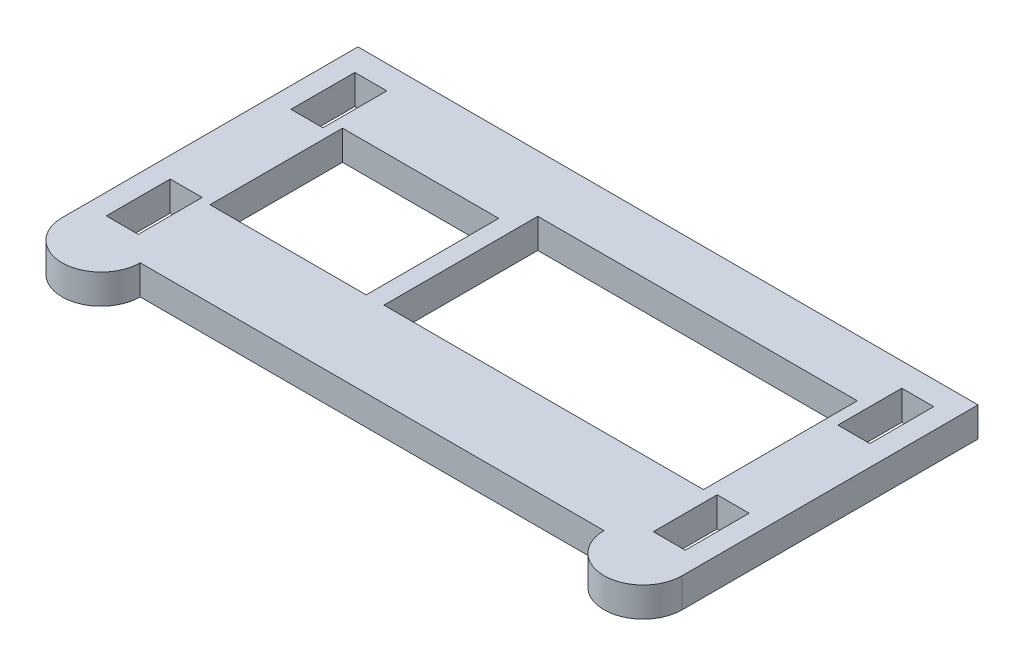
ISO-10303-21;
HEADER;
FILE_DESCRIPTION(('STEP AP214'),'2;1');
FILE_NAME('part.step','',(''),(''),'','','');
FILE_SCHEMA(('AUTOMOTIVE_DESIGN { 1 0 10303 214 1 1 1 1 }'));
ENDSEC;
DATA;
#1=APPLICATION_CONTEXT('core data for automotive mechanical design processes');
#2=APPLICATION_PROTOCOL_DEFINITION('international standard','automotive_design',2000,#1);
#3=PRODUCT_CONTEXT('',#1,'mechanical');
#4=PRODUCT('Part','Part','',(#3));
#5=PRODUCT_RELATED_PRODUCT_CATEGORY('part','',(#4));
#6=PRODUCT_DEFINITION_FORMATION('','',#4);
#7=PRODUCT_DEFINITION_CONTEXT('part definition',#1,'design');
#8=PRODUCT_DEFINITION('design','',#6,#7);
#9=PRODUCT_DEFINITION_SHAPE('','',#8);
#10=(LENGTH_UNIT() NAMED_UNIT(*) SI_UNIT(.MILLI.,.METRE.));
#11=(NAMED_UNIT(*) PLANE_ANGLE_UNIT() SI_UNIT($,.RADIAN.));
#12=(NAMED_UNIT(*) SI_UNIT($,.STERADIAN.) SOLID_ANGLE_UNIT());
#13=UNCERTAINTY_MEASURE_WITH_UNIT(LENGTH_MEASURE(1.E-05),#10,'distance_accuracy_value','');
#14=(GEOMETRIC_REPRESENTATION_CONTEXT(3) GLOBAL_UNCERTAINTY_ASSIGNED_CONTEXT((#13)) GLOBAL_UNIT_ASSIGNED_CONTEXT((#10,
#11,#12)) REPRESENTATION_CONTEXT('',''));
#15=CARTESIAN_POINT('',(0.,0.,0.));
#16=DIRECTION('',(0.,0.,1.));
#17=DIRECTION('',(1.,0.,0.));
#18=AXIS2_PLACEMENT_3D('',#15,#16,#17);
#19=CARTESIAN_POINT('',(-29.083,3.175,15.875));
#20=DIRECTION('',(0.,-1.,0.));
#21=DIRECTION('',(0.,0.,-1.));
#22=AXIS2_PLACEMENT_3D('',#19,#20,#21);
#23=PLANE('',#22);
#24=DIRECTION('',(0.,0.,1.));
#25=VECTOR('',#24,1.);
#26=CARTESIAN_POINT('',(-7.87399999999999,3.175,-9.77899999999999));
#27=LINE('',#26,#25);
#28=CARTESIAN_POINT('',(-7.87399999999999,3.175,-9.77899999999999));
#29=VERTEX_POINT('',#28);
#30=CARTESIAN_POINT('',(-7.87399999999999,3.175,6.73100000000001));
#31=VERTEX_POINT('',#30);
#32=EDGE_CURVE('E266',#29,#31,#27,.T.);
#33=ORIENTED_EDGE('',*,*,#32,.F.);
#34=DIRECTION('',(-1.,0.,0.));
#35=VECTOR('',#34,1.);
#36=CARTESIAN_POINT('',(-7.87399999999999,3.175,-9.77899999999999));
#37=LINE('',#36,#35);
#38=CARTESIAN_POINT('',(26.416,3.175,-9.77899999999999));
#39=VERTEX_POINT('',#38);
#40=EDGE_CURVE('E274',#39,#29,#37,.T.);
#41=ORIENTED_EDGE('',*,*,#40,.F.);
#42=DIRECTION('',(0.,0.,-1.));
#43=VECTOR('',#42,1.);
#44=CARTESIAN_POINT('',(26.416,3.175,-9.77899999999999));
#45=LINE('',#44,#43);
#46=CARTESIAN_POINT('',(26.416,3.175,6.73100000000001));
#47=VERTEX_POINT('',#46);
#48=EDGE_CURVE('E271',#47,#39,#45,.T.);
#49=ORIENTED_EDGE('',*,*,#48,.F.);
#50=DIRECTION('',(1.,0.,0.));
#51=VECTOR('',#50,1.);
#52=CARTESIAN_POINT('',(-7.87399999999999,3.175,6.73100000000001));
#53=LINE('',#52,#51);
#54=EDGE_CURVE('E268',#31,#47,#53,.T.);
#55=ORIENTED_EDGE('',*,*,#54,.F.);
#56=EDGE_LOOP('',(#33,#41,#49,#55));
#57=FACE_BOUND('',#56,.T.);
#58=DIRECTION('',(-1.,0.,0.));
#59=VECTOR('',#58,1.);
#60=CARTESIAN_POINT('',(-31.0642,3.175,6.47700000000002));
#61=LINE('',#60,#59);
#62=CARTESIAN_POINT('',(-27.6352,3.175,6.47700000000002));
#63=VERTEX_POINT('',#62);
#64=CARTESIAN_POINT('',(-31.0642,3.175,6.47700000000002));
#65=VERTEX_POINT('',#64);
#66=EDGE_CURVE('E328',#63,#65,#61,.T.);
#67=ORIENTED_EDGE('',*,*,#66,.F.);
#68=DIRECTION('',(0.,0.,-1.));
#69=VECTOR('',#68,1.);
#70=CARTESIAN_POINT('',(-27.6352,3.175,6.47700000000002));
#71=LINE('',#70,#69);
#72=CARTESIAN_POINT('',(-27.6352,3.175,13.335));
#73=VERTEX_POINT('',#72);
#74=EDGE_CURVE('E336',#73,#63,#71,.T.);
#75=ORIENTED_EDGE('',*,*,#74,.F.);
#76=DIRECTION('',(1.,0.,0.));
#77=VECTOR('',#76,1.);
#78=CARTESIAN_POINT('',(-31.0642,3.175,13.335));
#79=LINE('',#78,#77);
#80=CARTESIAN_POINT('',(-31.0642,3.175,13.335));
#81=VERTEX_POINT('',#80);
#82=EDGE_CURVE('E333',#81,#73,#79,.T.);
#83=ORIENTED_EDGE('',*,*,#82,.F.);
#84=DIRECTION('',(0.,0.,1.));
#85=VECTOR('',#84,1.);
#86=CARTESIAN_POINT('',(-31.0642,3.175,6.47700000000002));
#87=LINE('',#86,#85);
#88=EDGE_CURVE('E330',#65,#81,#87,.T.);
#89=ORIENTED_EDGE('',*,*,#88,.F.);
#90=EDGE_LOOP('',(#67,#75,#83,#89));
#91=FACE_BOUND('',#90,.T.);
#92=DIRECTION('',(0.,0.,-1.));
#93=VECTOR('',#92,1.);
#94=CARTESIAN_POINT('',(31.0642,3.175,-13.335));
#95=LINE('',#94,#93);
#96=CARTESIAN_POINT('',(31.0642,3.175,-6.477));
#97=VERTEX_POINT('',#96);
#98=CARTESIAN_POINT('',(31.0642,3.175,-13.335));
#99=VERTEX_POINT('',#98);
#100=EDGE_CURVE('E390',#97,#99,#95,.T.);
#101=ORIENTED_EDGE('',*,*,#100,.F.);
#102=DIRECTION('',(1.,0.,0.));
#103=VECTOR('',#102,1.);
#104=CARTESIAN_POINT('',(31.0642,3.175,-6.477));
#105=LINE('',#104,#103);
#106=CARTESIAN_POINT('',(27.6352,3.175,-6.477));
#107=VERTEX_POINT('',#106);
#108=EDGE_CURVE('E398',#107,#97,#105,.T.);
#109=ORIENTED_EDGE('',*,*,#108,.F.);
#110=DIRECTION('',(0.,0.,1.));
#111=VECTOR('',#110,1.);
#112=CARTESIAN_POINT('',(27.6352,3.175,-13.335));
#113=LINE('',#112,#111);
#114=CARTESIAN_POINT('',(27.6352,3.175,-13.335));
#115=VERTEX_POINT('',#114);
#116=EDGE_CURVE('E395',#115,#107,#113,.T.);
#117=ORIENTED_EDGE('',*,*,#116,.F.);
#118=DIRECTION('',(-1.,0.,0.));
#119=VECTOR('',#118,1.);
#120=CARTESIAN_POINT('',(31.0642,3.175,-13.335));
#121=LINE('',#120,#119);
#122=EDGE_CURVE('E392',#99,#115,#121,.T.);
#123=ORIENTED_EDGE('',*,*,#122,.F.);
#124=EDGE_LOOP('',(#101,#109,#117,#123));
#125=FACE_BOUND('',#124,.T.);
#126=DIRECTION('',(0.,0.,-1.));
#127=VECTOR('',#126,1.);
#128=CARTESIAN_POINT('',(33.274,3.175,15.875));
#129=LINE('',#128,#127);
#130=CARTESIAN_POINT('',(33.274,3.175,15.875));
#131=VERTEX_POINT('',#130);
#132=CARTESIAN_POINT('',(33.274,3.175,-15.875));
#133=VERTEX_POINT('',#132);
#134=EDGE_CURVE('E421',#131,#133,#129,.T.);
#135=ORIENTED_EDGE('',*,*,#134,.T.);
#136=DIRECTION('',(-1.,0.,0.));
#137=VECTOR('',#136,1.);
#138=CARTESIAN_POINT('',(-33.274,3.175,-15.875));
#139=LINE('',#138,#137);
#140=CARTESIAN_POINT('',(-33.274,3.175,-15.875));
#141=VERTEX_POINT('',#140);
#142=EDGE_CURVE('E424',#133,#141,#139,.T.);
#143=ORIENTED_EDGE('',*,*,#142,.T.);
#144=DIRECTION('',(0.,0.,1.));
#145=VECTOR('',#144,1.);
#146=CARTESIAN_POINT('',(-33.274,3.175,15.875));
#147=LINE('',#146,#145);
#148=CARTESIAN_POINT('',(-33.274,3.175,15.875));
#149=VERTEX_POINT('',#148);
#150=EDGE_CURVE('E427',#141,#149,#147,.T.);
#151=ORIENTED_EDGE('',*,*,#150,.T.);
#152=CARTESIAN_POINT('',(-29.083,3.175,15.875));
#153=DIRECTION('',(0.,1.,0.));
#154=DIRECTION('',(0.,0.,-1.));
#155=AXIS2_PLACEMENT_3D('',#152,#153,#154);
#156=CIRCLE('',#155,4.191);
#157=CARTESIAN_POINT('',(-24.892,3.175,15.875));
#158=VERTEX_POINT('',#157);
#159=EDGE_CURVE('E429',#149,#158,#156,.T.);
#160=ORIENTED_EDGE('',*,*,#159,.T.);
#161=DIRECTION('',(1.,0.,0.));
#162=VECTOR('',#161,1.);
#163=CARTESIAN_POINT('',(-24.892,3.175,15.875));
#164=LINE('',#163,#162);
#165=CARTESIAN_POINT('',(24.892,3.175,15.875));
#166=VERTEX_POINT('',#165);
#167=EDGE_CURVE('E431',#158,#166,#164,.T.);
#168=ORIENTED_EDGE('',*,*,#167,.T.);
#169=CARTESIAN_POINT('',(29.083,3.175,15.875));
#170=DIRECTION('',(0.,1.,0.));
#171=DIRECTION('',(0.,0.,1.));
#172=AXIS2_PLACEMENT_3D('',#169,#170,#171);
#173=CIRCLE('',#172,4.19099999999999);
#174=EDGE_CURVE('E433',#166,#131,#173,.T.);
#175=ORIENTED_EDGE('',*,*,#174,.T.);
#176=EDGE_LOOP('',(#135,#143,#151,#160,#168,#175));
#177=FACE_BOUND('',#176,.T.);
#178=DIRECTION('',(0.,0.,-1.));
#179=VECTOR('',#178,1.);
#180=CARTESIAN_POINT('',(31.0642,3.175,6.477));
#181=LINE('',#180,#179);
#182=CARTESIAN_POINT('',(31.0642,3.175,13.335));
#183=VERTEX_POINT('',#182);
#184=CARTESIAN_POINT('',(31.0642,3.175,6.477));
#185=VERTEX_POINT('',#184);
#186=EDGE_CURVE('E359',#183,#185,#181,.T.);
#187=ORIENTED_EDGE('',*,*,#186,.F.);
#188=DIRECTION('',(1.,0.,0.));
#189=VECTOR('',#188,1.);
#190=CARTESIAN_POINT('',(31.0642,3.175,13.335));
#191=LINE('',#190,#189);
#192=CARTESIAN_POINT('',(27.6352,3.175,13.335));
#193=VERTEX_POINT('',#192);
#194=EDGE_CURVE('E367',#193,#183,#191,.T.);
#195=ORIENTED_EDGE('',*,*,#194,.F.);
#196=DIRECTION('',(0.,0.,1.));
#197=VECTOR('',#196,1.);
#198=CARTESIAN_POINT('',(27.6352,3.175,6.477));
#199=LINE('',#198,#197);
#200=CARTESIAN_POINT('',(27.6352,3.175,6.477));
#201=VERTEX_POINT('',#200);
#202=EDGE_CURVE('E364',#201,#193,#199,.T.);
#203=ORIENTED_EDGE('',*,*,#202,.F.);
#204=DIRECTION('',(-1.,0.,0.));
#205=VECTOR('',#204,1.);
#206=CARTESIAN_POINT('',(31.0642,3.175,6.477));
#207=LINE('',#206,#205);
#208=EDGE_CURVE('E361',#185,#201,#207,.T.);
#209=ORIENTED_EDGE('',*,*,#208,.F.);
#210=EDGE_LOOP('',(#187,#195,#203,#209));
#211=FACE_BOUND('',#210,.T.);
#212=DIRECTION('',(-1.,0.,0.));
#213=VECTOR('',#212,1.);
#214=CARTESIAN_POINT('',(-31.0642,3.175,-13.335));
#215=LINE('',#214,#213);
#216=CARTESIAN_POINT('',(-27.6352,3.175,-13.335));
#217=VERTEX_POINT('',#216);
#218=CARTESIAN_POINT('',(-31.0642,3.175,-13.335));
#219=VERTEX_POINT('',#218);
#220=EDGE_CURVE('E297',#217,#219,#215,.T.);
#221=ORIENTED_EDGE('',*,*,#220,.F.);
#222=DIRECTION('',(0.,0.,-1.));
#223=VECTOR('',#222,1.);
#224=CARTESIAN_POINT('',(-27.6352,3.175,-13.335));
#225=LINE('',#224,#223);
#226=CARTESIAN_POINT('',(-27.6352,3.175,-6.47699999999999));
#227=VERTEX_POINT('',#226);
#228=EDGE_CURVE('E305',#227,#217,#225,.T.);
#229=ORIENTED_EDGE('',*,*,#228,.F.);
#230=DIRECTION('',(1.,0.,0.));
#231=VECTOR('',#230,1.);
#232=CARTESIAN_POINT('',(-31.0642,3.175,-6.47699999999998));
#233=LINE('',#232,#231);
#234=CARTESIAN_POINT('',(-31.0642,3.175,-6.47699999999998));
#235=VERTEX_POINT('',#234);
#236=EDGE_CURVE('E302',#235,#227,#233,.T.);
#237=ORIENTED_EDGE('',*,*,#236,.F.);
#238=DIRECTION('',(0.,0.,1.));
#239=VECTOR('',#238,1.);
#240=CARTESIAN_POINT('',(-31.0642,3.175,-13.335));
#241=LINE('',#240,#239);
#242=EDGE_CURVE('E299',#219,#235,#241,.T.);
#243=ORIENTED_EDGE('',*,*,#242,.F.);
#244=EDGE_LOOP('',(#221,#229,#237,#243));
#245=FACE_BOUND('',#244,.T.);
#246=DIRECTION('',(0.,0.,1.));
#247=VECTOR('',#246,1.);
#248=CARTESIAN_POINT('',(-26.543,3.175,-7.49299999999999));
#249=LINE('',#248,#247);
#250=CARTESIAN_POINT('',(-26.543,3.175,-7.49299999999999));
#251=VERTEX_POINT('',#250);
#252=CARTESIAN_POINT('',(-26.543,3.175,6.73100000000001));
#253=VERTEX_POINT('',#252);
#254=EDGE_CURVE('E230',#251,#253,#249,.T.);
#255=ORIENTED_EDGE('',*,*,#254,.F.);
#256=DIRECTION('',(-1.,0.,0.));
#257=VECTOR('',#256,1.);
#258=CARTESIAN_POINT('',(-26.543,3.175,-7.49299999999999));
#259=LINE('',#258,#257);
#260=CARTESIAN_POINT('',(-9.779,3.175,-7.49299999999999));
#261=VERTEX_POINT('',#260);
#262=EDGE_CURVE('E252',#261,#251,#259,.T.);
#263=ORIENTED_EDGE('',*,*,#262,.F.);
#264=DIRECTION('',(0.,0.,-1.));
#265=VECTOR('',#264,1.);
#266=CARTESIAN_POINT('',(-9.779,3.175,-7.49299999999999));
#267=LINE('',#266,#265);
#268=CARTESIAN_POINT('',(-9.77899999999999,3.175,6.73100000000001));
#269=VERTEX_POINT('',#268);
#270=EDGE_CURVE('E250',#269,#261,#267,.T.);
#271=ORIENTED_EDGE('',*,*,#270,.F.);
#272=DIRECTION('',(1.,0.,0.));
#273=VECTOR('',#272,1.);
#274=CARTESIAN_POINT('',(-26.543,3.175,6.73100000000001));
#275=LINE('',#274,#273);
#276=EDGE_CURVE('E238',#253,#269,#275,.T.);
#277=ORIENTED_EDGE('',*,*,#276,.F.);
#278=EDGE_LOOP('',(#255,#263,#271,#277));
#279=FACE_BOUND('',#278,.T.);
#280=ADVANCED_FACE('F33',(#57,#91,#125,#177,#211,#245,#279),#23,.F.);
#281=CARTESIAN_POINT('',(-29.083,0.,15.875));
#282=DIRECTION('',(0.,-1.,0.));
#283=DIRECTION('',(0.,0.,-1.));
#284=AXIS2_PLACEMENT_3D('',#281,#282,#283);
#285=PLANE('',#284);
#286=DIRECTION('',(0.,0.,-1.));
#287=VECTOR('',#286,1.);
#288=CARTESIAN_POINT('',(33.274,0.,15.875));
#289=LINE('',#288,#287);
#290=CARTESIAN_POINT('',(33.274,0.,15.875));
#291=VERTEX_POINT('',#290);
#292=CARTESIAN_POINT('',(33.274,0.,-15.875));
#293=VERTEX_POINT('',#292);
#294=EDGE_CURVE('E420',#291,#293,#289,.T.);
#295=ORIENTED_EDGE('',*,*,#294,.F.);
#296=CARTESIAN_POINT('',(29.083,0.,15.875));
#297=DIRECTION('',(0.,1.,0.));
#298=DIRECTION('',(0.,0.,1.));
#299=AXIS2_PLACEMENT_3D('',#296,#297,#298);
#300=CIRCLE('',#299,4.19099999999999);
#301=CARTESIAN_POINT('',(24.892,0.,15.875));
#302=VERTEX_POINT('',#301);
#303=EDGE_CURVE('E425',#302,#291,#300,.T.);
#304=ORIENTED_EDGE('',*,*,#303,.F.);
#305=DIRECTION('',(1.,0.,0.));
#306=VECTOR('',#305,1.);
#307=CARTESIAN_POINT('',(-24.892,0.,15.875));
#308=LINE('',#307,#306);
#309=CARTESIAN_POINT('',(-24.892,0.,15.875));
#310=VERTEX_POINT('',#309);
#311=EDGE_CURVE('E444',#310,#302,#308,.T.);
#312=ORIENTED_EDGE('',*,*,#311,.F.);
#313=CARTESIAN_POINT('',(-29.083,0.,15.875));
#314=DIRECTION('',(0.,1.,0.));
#315=DIRECTION('',(0.,0.,-1.));
#316=AXIS2_PLACEMENT_3D('',#313,#314,#315);
#317=CIRCLE('',#316,4.191);
#318=CARTESIAN_POINT('',(-33.274,0.,15.875));
#319=VERTEX_POINT('',#318);
#320=EDGE_CURVE('E442',#319,#310,#317,.T.);
#321=ORIENTED_EDGE('',*,*,#320,.F.);
#322=DIRECTION('',(0.,0.,1.));
#323=VECTOR('',#322,1.);
#324=CARTESIAN_POINT('',(-33.274,0.,15.875));
#325=LINE('',#324,#323);
#326=CARTESIAN_POINT('',(-33.274,0.,-15.875));
#327=VERTEX_POINT('',#326);
#328=EDGE_CURVE('E440',#327,#319,#325,.T.);
#329=ORIENTED_EDGE('',*,*,#328,.F.);
#330=DIRECTION('',(-1.,0.,0.));
#331=VECTOR('',#330,1.);
#332=CARTESIAN_POINT('',(-33.274,0.,-15.875));
#333=LINE('',#332,#331);
#334=EDGE_CURVE('E438',#293,#327,#333,.T.);
#335=ORIENTED_EDGE('',*,*,#334,.F.);
#336=EDGE_LOOP('',(#295,#304,#312,#321,#329,#335));
#337=FACE_BOUND('',#336,.T.);
#338=DIRECTION('',(1.,0.,0.));
#339=VECTOR('',#338,1.);
#340=CARTESIAN_POINT('',(31.0642,0.,-6.477));
#341=LINE('',#340,#339);
#342=CARTESIAN_POINT('',(27.6352,0.,-6.477));
#343=VERTEX_POINT('',#342);
#344=CARTESIAN_POINT('',(31.0642,0.,-6.477));
#345=VERTEX_POINT('',#344);
#346=EDGE_CURVE('E393',#343,#345,#341,.T.);
#347=ORIENTED_EDGE('',*,*,#346,.T.);
#348=DIRECTION('',(0.,0.,-1.));
#349=VECTOR('',#348,1.);
#350=CARTESIAN_POINT('',(31.0642,0.,-13.335));
#351=LINE('',#350,#349);
#352=CARTESIAN_POINT('',(31.0642,0.,-13.335));
#353=VERTEX_POINT('',#352);
#354=EDGE_CURVE('E389',#345,#353,#351,.T.);
#355=ORIENTED_EDGE('',*,*,#354,.T.);
#356=DIRECTION('',(-1.,0.,0.));
#357=VECTOR('',#356,1.);
#358=CARTESIAN_POINT('',(31.0642,0.,-13.335));
#359=LINE('',#358,#357);
#360=CARTESIAN_POINT('',(27.6352,0.,-13.335));
#361=VERTEX_POINT('',#360);
#362=EDGE_CURVE('E403',#353,#361,#359,.T.);
#363=ORIENTED_EDGE('',*,*,#362,.T.);
#364=DIRECTION('',(0.,0.,1.));
#365=VECTOR('',#364,1.);
#366=CARTESIAN_POINT('',(27.6352,0.,-13.335));
#367=LINE('',#366,#365);
#368=EDGE_CURVE('E406',#361,#343,#367,.T.);
#369=ORIENTED_EDGE('',*,*,#368,.T.);
#370=EDGE_LOOP('',(#347,#355,#363,#369));
#371=FACE_BOUND('',#370,.T.);
#372=DIRECTION('',(1.,0.,0.));
#373=VECTOR('',#372,1.);
#374=CARTESIAN_POINT('',(31.0642,0.,13.335));
#375=LINE('',#374,#373);
#376=CARTESIAN_POINT('',(27.6352,0.,13.335));
#377=VERTEX_POINT('',#376);
#378=CARTESIAN_POINT('',(31.0642,0.,13.335));
#379=VERTEX_POINT('',#378);
#380=EDGE_CURVE('E362',#377,#379,#375,.T.);
#381=ORIENTED_EDGE('',*,*,#380,.T.);
#382=DIRECTION('',(0.,0.,-1.));
#383=VECTOR('',#382,1.);
#384=CARTESIAN_POINT('',(31.0642,0.,6.477));
#385=LINE('',#384,#383);
#386=CARTESIAN_POINT('',(31.0642,0.,6.477));
#387=VERTEX_POINT('',#386);
#388=EDGE_CURVE('E358',#379,#387,#385,.T.);
#389=ORIENTED_EDGE('',*,*,#388,.T.);
#390=DIRECTION('',(-1.,0.,0.));
#391=VECTOR('',#390,1.);
#392=CARTESIAN_POINT('',(31.0642,0.,6.477));
#393=LINE('',#392,#391);
#394=CARTESIAN_POINT('',(27.6352,0.,6.477));
#395=VERTEX_POINT('',#394);
#396=EDGE_CURVE('E372',#387,#395,#393,.T.);
#397=ORIENTED_EDGE('',*,*,#396,.T.);
#398=DIRECTION('',(0.,0.,1.));
#399=VECTOR('',#398,1.);
#400=CARTESIAN_POINT('',(27.6352,0.,6.477));
#401=LINE('',#400,#399);
#402=EDGE_CURVE('E375',#395,#377,#401,.T.);
#403=ORIENTED_EDGE('',*,*,#402,.T.);
#404=EDGE_LOOP('',(#381,#389,#397,#403));
#405=FACE_BOUND('',#404,.T.);
#406=DIRECTION('',(0.,0.,-1.));
#407=VECTOR('',#406,1.);
#408=CARTESIAN_POINT('',(-27.6352,0.,6.47700000000002));
#409=LINE('',#408,#407);
#410=CARTESIAN_POINT('',(-27.6352,0.,13.335));
#411=VERTEX_POINT('',#410);
#412=CARTESIAN_POINT('',(-27.6352,0.,6.47700000000002));
#413=VERTEX_POINT('',#412);
#414=EDGE_CURVE('E331',#411,#413,#409,.T.);
#415=ORIENTED_EDGE('',*,*,#414,.T.);
#416=DIRECTION('',(-1.,0.,0.));
#417=VECTOR('',#416,1.);
#418=CARTESIAN_POINT('',(-31.0642,0.,6.47700000000002));
#419=LINE('',#418,#417);
#420=CARTESIAN_POINT('',(-31.0642,0.,6.47700000000002));
#421=VERTEX_POINT('',#420);
#422=EDGE_CURVE('E327',#413,#421,#419,.T.);
#423=ORIENTED_EDGE('',*,*,#422,.T.);
#424=DIRECTION('',(0.,0.,1.));
#425=VECTOR('',#424,1.);
#426=CARTESIAN_POINT('',(-31.0642,0.,6.47700000000002));
#427=LINE('',#426,#425);
#428=CARTESIAN_POINT('',(-31.0642,0.,13.335));
#429=VERTEX_POINT('',#428);
#430=EDGE_CURVE('E341',#421,#429,#427,.T.);
#431=ORIENTED_EDGE('',*,*,#430,.T.);
#432=DIRECTION('',(1.,0.,0.));
#433=VECTOR('',#432,1.);
#434=CARTESIAN_POINT('',(-31.0642,0.,13.335));
#435=LINE('',#434,#433);
#436=EDGE_CURVE('E344',#429,#411,#435,.T.);
#437=ORIENTED_EDGE('',*,*,#436,.T.);
#438=EDGE_LOOP('',(#415,#423,#431,#437));
#439=FACE_BOUND('',#438,.T.);
#440=DIRECTION('',(0.,0.,-1.));
#441=VECTOR('',#440,1.);
#442=CARTESIAN_POINT('',(-27.6352,0.,-13.335));
#443=LINE('',#442,#441);
#444=CARTESIAN_POINT('',(-27.6352,0.,-6.47699999999999));
#445=VERTEX_POINT('',#444);
#446=CARTESIAN_POINT('',(-27.6352,0.,-13.335));
#447=VERTEX_POINT('',#446);
#448=EDGE_CURVE('E300',#445,#447,#443,.T.);
#449=ORIENTED_EDGE('',*,*,#448,.T.);
#450=DIRECTION('',(-1.,0.,0.));
#451=VECTOR('',#450,1.);
#452=CARTESIAN_POINT('',(-31.0642,0.,-13.335));
#453=LINE('',#452,#451);
#454=CARTESIAN_POINT('',(-31.0642,0.,-13.335));
#455=VERTEX_POINT('',#454);
#456=EDGE_CURVE('E296',#447,#455,#453,.T.);
#457=ORIENTED_EDGE('',*,*,#456,.T.);
#458=DIRECTION('',(0.,0.,1.));
#459=VECTOR('',#458,1.);
#460=CARTESIAN_POINT('',(-31.0642,0.,-13.335));
#461=LINE('',#460,#459);
#462=CARTESIAN_POINT('',(-31.0642,0.,-6.47699999999998));
#463=VERTEX_POINT('',#462);
#464=EDGE_CURVE('E310',#455,#463,#461,.T.);
#465=ORIENTED_EDGE('',*,*,#464,.T.);
#466=DIRECTION('',(1.,0.,0.));
#467=VECTOR('',#466,1.);
#468=CARTESIAN_POINT('',(-31.0642,0.,-6.47699999999998));
#469=LINE('',#468,#467);
#470=EDGE_CURVE('E313',#463,#445,#469,.T.);
#471=ORIENTED_EDGE('',*,*,#470,.T.);
#472=EDGE_LOOP('',(#449,#457,#465,#471));
#473=FACE_BOUND('',#472,.T.);
#474=DIRECTION('',(-1.,0.,0.));
#475=VECTOR('',#474,1.);
#476=CARTESIAN_POINT('',(-7.87399999999999,0.,-9.77899999999999));
#477=LINE('',#476,#475);
#478=CARTESIAN_POINT('',(26.416,0.,-9.77899999999999));
#479=VERTEX_POINT('',#478);
#480=CARTESIAN_POINT('',(-7.87399999999999,0.,-9.77899999999999));
#481=VERTEX_POINT('',#480);
#482=EDGE_CURVE('E269',#479,#481,#477,.T.);
#483=ORIENTED_EDGE('',*,*,#482,.T.);
#484=DIRECTION('',(0.,0.,1.));
#485=VECTOR('',#484,1.);
#486=CARTESIAN_POINT('',(-7.87399999999999,0.,-9.77899999999999));
#487=LINE('',#486,#485);
#488=CARTESIAN_POINT('',(-7.87399999999999,0.,6.73100000000001));
#489=VERTEX_POINT('',#488);
#490=EDGE_CURVE('E246',#481,#489,#487,.T.);
#491=ORIENTED_EDGE('',*,*,#490,.T.);
#492=DIRECTION('',(1.,0.,0.));
#493=VECTOR('',#492,1.);
#494=CARTESIAN_POINT('',(-7.87399999999999,0.,6.73100000000001));
#495=LINE('',#494,#493);
#496=CARTESIAN_POINT('',(26.416,0.,6.73100000000001));
#497=VERTEX_POINT('',#496);
#498=EDGE_CURVE('E279',#489,#497,#495,.T.);
#499=ORIENTED_EDGE('',*,*,#498,.T.);
#500=DIRECTION('',(0.,0.,-1.));
#501=VECTOR('',#500,1.);
#502=CARTESIAN_POINT('',(26.416,0.,-9.77899999999999));
#503=LINE('',#502,#501);
#504=EDGE_CURVE('E282',#497,#479,#503,.T.);
#505=ORIENTED_EDGE('',*,*,#504,.T.);
#506=EDGE_LOOP('',(#483,#491,#499,#505));
#507=FACE_BOUND('',#506,.T.);
#508=DIRECTION('',(-1.,0.,0.));
#509=VECTOR('',#508,1.);
#510=CARTESIAN_POINT('',(-26.543,0.,-7.49299999999999));
#511=LINE('',#510,#509);
#512=CARTESIAN_POINT('',(-9.779,0.,-7.49299999999999));
#513=VERTEX_POINT('',#512);
#514=CARTESIAN_POINT('',(-26.543,0.,-7.49299999999999));
#515=VERTEX_POINT('',#514);
#516=EDGE_CURVE('E239',#513,#515,#511,.T.);
#517=ORIENTED_EDGE('',*,*,#516,.T.);
#518=DIRECTION('',(0.,0.,1.));
#519=VECTOR('',#518,1.);
#520=CARTESIAN_POINT('',(-26.543,0.,-7.49299999999999));
#521=LINE('',#520,#519);
#522=CARTESIAN_POINT('',(-26.543,0.,6.73100000000001));
#523=VERTEX_POINT('',#522);
#524=EDGE_CURVE('E56',#515,#523,#521,.T.);
#525=ORIENTED_EDGE('',*,*,#524,.T.);
#526=DIRECTION('',(1.,0.,0.));
#527=VECTOR('',#526,1.);
#528=CARTESIAN_POINT('',(-26.543,0.,6.73100000000001));
#529=LINE('',#528,#527);
#530=CARTESIAN_POINT('',(-9.77899999999999,0.,6.73100000000001));
#531=VERTEX_POINT('',#530);
#532=EDGE_CURVE('E245',#523,#531,#529,.T.);
#533=ORIENTED_EDGE('',*,*,#532,.T.);
#534=DIRECTION('',(0.,0.,-1.));
#535=VECTOR('',#534,1.);
#536=CARTESIAN_POINT('',(-9.779,0.,-7.49299999999999));
#537=LINE('',#536,#535);
#538=EDGE_CURVE('E258',#531,#513,#537,.T.);
#539=ORIENTED_EDGE('',*,*,#538,.T.);
#540=EDGE_LOOP('',(#517,#525,#533,#539));
#541=FACE_BOUND('',#540,.T.);
#542=ADVANCED_FACE('F468',(#337,#371,#405,#439,#473,#507,#541),#285,.T.);
#543=CARTESIAN_POINT('',(33.274,3.175,15.875));
#544=DIRECTION('',(-1.,0.,0.));
#545=DIRECTION('',(0.,0.,1.));
#546=AXIS2_PLACEMENT_3D('',#543,#544,#545);
#547=PLANE('',#546);
#548=ORIENTED_EDGE('',*,*,#294,.T.);
#549=DIRECTION('',(0.,-1.,0.));
#550=VECTOR('',#549,1.);
#551=CARTESIAN_POINT('',(33.274,3.175,-15.875));
#552=LINE('',#551,#550);
#553=EDGE_CURVE('E11',#133,#293,#552,.T.);
#554=ORIENTED_EDGE('',*,*,#553,.F.);
#555=ORIENTED_EDGE('',*,*,#134,.F.);
#556=DIRECTION('',(0.,-1.,0.));
#557=VECTOR('',#556,1.);
#558=CARTESIAN_POINT('',(33.274,3.175,15.875));
#559=LINE('',#558,#557);
#560=EDGE_CURVE('E435',#131,#291,#559,.T.);
#561=ORIENTED_EDGE('',*,*,#560,.T.);
#562=EDGE_LOOP('',(#548,#554,#555,#561));
#563=FACE_BOUND('',#562,.T.);
#564=ADVANCED_FACE('F35',(#563),#547,.F.);
#565=CARTESIAN_POINT('',(-33.274,3.175,-15.875));
#566=DIRECTION('',(0.,0.,1.));
#567=DIRECTION('',(1.,0.,0.));
#568=AXIS2_PLACEMENT_3D('',#565,#566,#567);
#569=PLANE('',#568);
#570=ORIENTED_EDGE('',*,*,#334,.T.);
#571=DIRECTION('',(0.,-1.,0.));
#572=VECTOR('',#571,1.);
#573=CARTESIAN_POINT('',(-33.274,3.175,-15.875));
#574=LINE('',#573,#572);
#575=EDGE_CURVE('E41',#141,#327,#574,.T.);
#576=ORIENTED_EDGE('',*,*,#575,.F.);
#577=ORIENTED_EDGE('',*,*,#142,.F.);
#578=ORIENTED_EDGE('',*,*,#553,.T.);
#579=EDGE_LOOP('',(#570,#576,#577,#578));
#580=FACE_BOUND('',#579,.T.);
#581=ADVANCED_FACE('F486',(#580),#569,.F.);
#582=CARTESIAN_POINT('',(-33.274,3.175,15.875));
#583=DIRECTION('',(1.,0.,0.));
#584=DIRECTION('',(0.,0.,-1.));
#585=AXIS2_PLACEMENT_3D('',#582,#583,#584);
#586=PLANE('',#585);
#587=ORIENTED_EDGE('',*,*,#328,.T.);
#588=DIRECTION('',(0.,-1.,0.));
#589=VECTOR('',#588,1.);
#590=CARTESIAN_POINT('',(-33.274,3.175,15.875));
#591=LINE('',#590,#589);
#592=EDGE_CURVE('E455',#149,#319,#591,.T.);
#593=ORIENTED_EDGE('',*,*,#592,.F.);
#594=ORIENTED_EDGE('',*,*,#150,.F.);
#595=ORIENTED_EDGE('',*,*,#575,.T.);
#596=EDGE_LOOP('',(#587,#593,#594,#595));
#597=FACE_BOUND('',#596,.T.);
#598=ADVANCED_FACE('F462',(#597),#586,.F.);
#599=CARTESIAN_POINT('',(-29.083,3.175,15.875));
#600=DIRECTION('',(0.,-1.,0.));
#601=DIRECTION('',(0.,0.,-1.));
#602=AXIS2_PLACEMENT_3D('',#599,#600,#601);
#603=CYLINDRICAL_SURFACE('',#602,4.191);
#604=ORIENTED_EDGE('',*,*,#320,.T.);
#605=DIRECTION('',(0.,-1.,0.));
#606=VECTOR('',#605,1.);
#607=CARTESIAN_POINT('',(-24.892,3.175,15.875));
#608=LINE('',#607,#606);
#609=EDGE_CURVE('E452',#158,#310,#608,.T.);
#610=ORIENTED_EDGE('',*,*,#609,.F.);
#611=ORIENTED_EDGE('',*,*,#159,.F.);
#612=ORIENTED_EDGE('',*,*,#592,.T.);
#613=EDGE_LOOP('',(#604,#610,#611,#612));
#614=FACE_BOUND('',#613,.T.);
#615=ADVANCED_FACE('F474',(#614),#603,.T.);
#616=CARTESIAN_POINT('',(-24.892,3.175,15.875));
#617=DIRECTION('',(0.,0.,-1.));
#618=DIRECTION('',(-1.,0.,0.));
#619=AXIS2_PLACEMENT_3D('',#616,#617,#618);
#620=PLANE('',#619);
#621=ORIENTED_EDGE('',*,*,#311,.T.);
#622=DIRECTION('',(0.,-1.,0.));
#623=VECTOR('',#622,1.);
#624=CARTESIAN_POINT('',(24.892,3.175,15.875));
#625=LINE('',#624,#623);
#626=EDGE_CURVE('E449',#166,#302,#625,.T.);
#627=ORIENTED_EDGE('',*,*,#626,.F.);
#628=ORIENTED_EDGE('',*,*,#167,.F.);
#629=ORIENTED_EDGE('',*,*,#609,.T.);
#630=EDGE_LOOP('',(#621,#627,#628,#629));
#631=FACE_BOUND('',#630,.T.);
#632=ADVANCED_FACE('F478',(#631),#620,.F.);
#633=CARTESIAN_POINT('',(29.083,3.175,15.875));
#634=DIRECTION('',(0.,-1.,0.));
#635=DIRECTION('',(0.,0.,-1.));
#636=AXIS2_PLACEMENT_3D('',#633,#634,#635);
#637=CYLINDRICAL_SURFACE('',#636,4.19099999999999);
#638=ORIENTED_EDGE('',*,*,#303,.T.);
#639=ORIENTED_EDGE('',*,*,#560,.F.);
#640=ORIENTED_EDGE('',*,*,#174,.F.);
#641=ORIENTED_EDGE('',*,*,#626,.T.);
#642=EDGE_LOOP('',(#638,#639,#640,#641));
#643=FACE_BOUND('',#642,.T.);
#644=ADVANCED_FACE('F489',(#643),#637,.T.);
#645=CARTESIAN_POINT('',(31.0642,3.175,-13.335));
#646=DIRECTION('',(-1.,0.,0.));
#647=DIRECTION('',(0.,0.,1.));
#648=AXIS2_PLACEMENT_3D('',#645,#646,#647);
#649=PLANE('',#648);
#650=ORIENTED_EDGE('',*,*,#354,.F.);
#651=DIRECTION('',(0.,-1.,0.));
#652=VECTOR('',#651,1.);
#653=CARTESIAN_POINT('',(31.0642,3.175,-6.477));
#654=LINE('',#653,#652);
#655=EDGE_CURVE('E400',#97,#345,#654,.T.);
#656=ORIENTED_EDGE('',*,*,#655,.F.);
#657=ORIENTED_EDGE('',*,*,#100,.T.);
#658=DIRECTION('',(0.,-1.,0.));
#659=VECTOR('',#658,1.);
#660=CARTESIAN_POINT('',(31.0642,3.175,-13.335));
#661=LINE('',#660,#659);
#662=EDGE_CURVE('E417',#99,#353,#661,.T.);
#663=ORIENTED_EDGE('',*,*,#662,.T.);
#664=EDGE_LOOP('',(#650,#656,#657,#663));
#665=FACE_BOUND('',#664,.T.);
#666=ADVANCED_FACE('F491',(#665),#649,.T.);
#667=CARTESIAN_POINT('',(31.0642,3.175,-13.335));
#668=DIRECTION('',(0.,0.,1.));
#669=DIRECTION('',(1.,0.,0.));
#670=AXIS2_PLACEMENT_3D('',#667,#668,#669);
#671=PLANE('',#670);
#672=ORIENTED_EDGE('',*,*,#362,.F.);
#673=ORIENTED_EDGE('',*,*,#662,.F.);
#674=ORIENTED_EDGE('',*,*,#122,.T.);
#675=DIRECTION('',(0.,-1.,0.));
#676=VECTOR('',#675,1.);
#677=CARTESIAN_POINT('',(27.6352,3.175,-13.335));
#678=LINE('',#677,#676);
#679=EDGE_CURVE('E415',#115,#361,#678,.T.);
#680=ORIENTED_EDGE('',*,*,#679,.T.);
#681=EDGE_LOOP('',(#672,#673,#674,#680));
#682=FACE_BOUND('',#681,.T.);
#683=ADVANCED_FACE('F497',(#682),#671,.T.);
#684=CARTESIAN_POINT('',(27.6352,3.175,-13.335));
#685=DIRECTION('',(1.,0.,0.));
#686=DIRECTION('',(0.,0.,-1.));
#687=AXIS2_PLACEMENT_3D('',#684,#685,#686);
#688=PLANE('',#687);
#689=ORIENTED_EDGE('',*,*,#368,.F.);
#690=ORIENTED_EDGE('',*,*,#679,.F.);
#691=ORIENTED_EDGE('',*,*,#116,.T.);
#692=DIRECTION('',(0.,-1.,0.));
#693=VECTOR('',#692,1.);
#694=CARTESIAN_POINT('',(27.6352,3.175,-6.477));
#695=LINE('',#694,#693);
#696=EDGE_CURVE('E413',#107,#343,#695,.T.);
#697=ORIENTED_EDGE('',*,*,#696,.T.);
#698=EDGE_LOOP('',(#689,#690,#691,#697));
#699=FACE_BOUND('',#698,.T.);
#700=ADVANCED_FACE('F513',(#699),#688,.T.);
#701=CARTESIAN_POINT('',(31.0642,3.175,-6.477));
#702=DIRECTION('',(0.,0.,-1.));
#703=DIRECTION('',(-1.,0.,0.));
#704=AXIS2_PLACEMENT_3D('',#701,#702,#703);
#705=PLANE('',#704);
#706=ORIENTED_EDGE('',*,*,#346,.F.);
#707=ORIENTED_EDGE('',*,*,#696,.F.);
#708=ORIENTED_EDGE('',*,*,#108,.T.);
#709=ORIENTED_EDGE('',*,*,#655,.T.);
#710=EDGE_LOOP('',(#706,#707,#708,#709));
#711=FACE_BOUND('',#710,.T.);
#712=ADVANCED_FACE('F517',(#711),#705,.T.);
#713=CARTESIAN_POINT('',(31.0642,3.175,6.477));
#714=DIRECTION('',(-1.,0.,0.));
#715=DIRECTION('',(0.,0.,1.));
#716=AXIS2_PLACEMENT_3D('',#713,#714,#715);
#717=PLANE('',#716);
#718=ORIENTED_EDGE('',*,*,#388,.F.);
#719=DIRECTION('',(0.,-1.,0.));
#720=VECTOR('',#719,1.);
#721=CARTESIAN_POINT('',(31.0642,3.175,13.335));
#722=LINE('',#721,#720);
#723=EDGE_CURVE('E369',#183,#379,#722,.T.);
#724=ORIENTED_EDGE('',*,*,#723,.F.);
#725=ORIENTED_EDGE('',*,*,#186,.T.);
#726=DIRECTION('',(0.,-1.,0.));
#727=VECTOR('',#726,1.);
#728=CARTESIAN_POINT('',(31.0642,3.175,6.477));
#729=LINE('',#728,#727);
#730=EDGE_CURVE('E386',#185,#387,#729,.T.);
#731=ORIENTED_EDGE('',*,*,#730,.T.);
#732=EDGE_LOOP('',(#718,#724,#725,#731));
#733=FACE_BOUND('',#732,.T.);
#734=ADVANCED_FACE('F521',(#733),#717,.T.);
#735=CARTESIAN_POINT('',(31.0642,3.175,6.477));
#736=DIRECTION('',(0.,0.,1.));
#737=DIRECTION('',(1.,0.,0.));
#738=AXIS2_PLACEMENT_3D('',#735,#736,#737);
#739=PLANE('',#738);
#740=ORIENTED_EDGE('',*,*,#396,.F.);
#741=ORIENTED_EDGE('',*,*,#730,.F.);
#742=ORIENTED_EDGE('',*,*,#208,.T.);
#743=DIRECTION('',(0.,-1.,0.));
#744=VECTOR('',#743,1.);
#745=CARTESIAN_POINT('',(27.6352,3.175,6.477));
#746=LINE('',#745,#744);
#747=EDGE_CURVE('E384',#201,#395,#746,.T.);
#748=ORIENTED_EDGE('',*,*,#747,.T.);
#749=EDGE_LOOP('',(#740,#741,#742,#748));
#750=FACE_BOUND('',#749,.T.);
#751=ADVANCED_FACE('F525',(#750),#739,.T.);
#752=CARTESIAN_POINT('',(27.6352,3.175,6.477));
#753=DIRECTION('',(1.,0.,0.));
#754=DIRECTION('',(0.,0.,-1.));
#755=AXIS2_PLACEMENT_3D('',#752,#753,#754);
#756=PLANE('',#755);
#757=ORIENTED_EDGE('',*,*,#402,.F.);
#758=ORIENTED_EDGE('',*,*,#747,.F.);
#759=ORIENTED_EDGE('',*,*,#202,.T.);
#760=DIRECTION('',(0.,-1.,0.));
#761=VECTOR('',#760,1.);
#762=CARTESIAN_POINT('',(27.6352,3.175,13.335));
#763=LINE('',#762,#761);
#764=EDGE_CURVE('E382',#193,#377,#763,.T.);
#765=ORIENTED_EDGE('',*,*,#764,.T.);
#766=EDGE_LOOP('',(#757,#758,#759,#765));
#767=FACE_BOUND('',#766,.T.);
#768=ADVANCED_FACE('F529',(#767),#756,.T.);
#769=CARTESIAN_POINT('',(31.0642,3.175,13.335));
#770=DIRECTION('',(0.,0.,-1.));
#771=DIRECTION('',(-1.,0.,0.));
#772=AXIS2_PLACEMENT_3D('',#769,#770,#771);
#773=PLANE('',#772);
#774=ORIENTED_EDGE('',*,*,#380,.F.);
#775=ORIENTED_EDGE('',*,*,#764,.F.);
#776=ORIENTED_EDGE('',*,*,#194,.T.);
#777=ORIENTED_EDGE('',*,*,#723,.T.);
#778=EDGE_LOOP('',(#774,#775,#776,#777));
#779=FACE_BOUND('',#778,.T.);
#780=ADVANCED_FACE('F533',(#779),#773,.T.);
#781=CARTESIAN_POINT('',(-31.0642,3.175,6.47700000000002));
#782=DIRECTION('',(0.,0.,1.));
#783=DIRECTION('',(1.,0.,0.));
#784=AXIS2_PLACEMENT_3D('',#781,#782,#783);
#785=PLANE('',#784);
#786=ORIENTED_EDGE('',*,*,#422,.F.);
#787=DIRECTION('',(0.,-1.,0.));
#788=VECTOR('',#787,1.);
#789=CARTESIAN_POINT('',(-27.6352,3.175,6.47700000000002));
#790=LINE('',#789,#788);
#791=EDGE_CURVE('E338',#63,#413,#790,.T.);
#792=ORIENTED_EDGE('',*,*,#791,.F.);
#793=ORIENTED_EDGE('',*,*,#66,.T.);
#794=DIRECTION('',(0.,-1.,0.));
#795=VECTOR('',#794,1.);
#796=CARTESIAN_POINT('',(-31.0642,3.175,6.47700000000002));
#797=LINE('',#796,#795);
#798=EDGE_CURVE('E355',#65,#421,#797,.T.);
#799=ORIENTED_EDGE('',*,*,#798,.T.);
#800=EDGE_LOOP('',(#786,#792,#793,#799));
#801=FACE_BOUND('',#800,.T.);
#802=ADVANCED_FACE('F537',(#801),#785,.T.);
#803=CARTESIAN_POINT('',(-31.0642,3.175,6.47700000000002));
#804=DIRECTION('',(1.,0.,0.));
#805=DIRECTION('',(0.,0.,-1.));
#806=AXIS2_PLACEMENT_3D('',#803,#804,#805);
#807=PLANE('',#806);
#808=ORIENTED_EDGE('',*,*,#430,.F.);
#809=ORIENTED_EDGE('',*,*,#798,.F.);
#810=ORIENTED_EDGE('',*,*,#88,.T.);
#811=DIRECTION('',(0.,-1.,0.));
#812=VECTOR('',#811,1.);
#813=CARTESIAN_POINT('',(-31.0642,3.175,13.335));
#814=LINE('',#813,#812);
#815=EDGE_CURVE('E353',#81,#429,#814,.T.);
#816=ORIENTED_EDGE('',*,*,#815,.T.);
#817=EDGE_LOOP('',(#808,#809,#810,#816));
#818=FACE_BOUND('',#817,.T.);
#819=ADVANCED_FACE('F541',(#818),#807,.T.);
#820=CARTESIAN_POINT('',(-31.0642,3.175,13.335));
#821=DIRECTION('',(0.,0.,-1.));
#822=DIRECTION('',(-1.,0.,0.));
#823=AXIS2_PLACEMENT_3D('',#820,#821,#822);
#824=PLANE('',#823);
#825=ORIENTED_EDGE('',*,*,#436,.F.);
#826=ORIENTED_EDGE('',*,*,#815,.F.);
#827=ORIENTED_EDGE('',*,*,#82,.T.);
#828=DIRECTION('',(0.,-1.,0.));
#829=VECTOR('',#828,1.);
#830=CARTESIAN_POINT('',(-27.6352,3.175,13.335));
#831=LINE('',#830,#829);
#832=EDGE_CURVE('E351',#73,#411,#831,.T.);
#833=ORIENTED_EDGE('',*,*,#832,.T.);
#834=EDGE_LOOP('',(#825,#826,#827,#833));
#835=FACE_BOUND('',#834,.T.);
#836=ADVANCED_FACE('F545',(#835),#824,.T.);
#837=CARTESIAN_POINT('',(-27.6352,3.175,6.47700000000002));
#838=DIRECTION('',(-1.,0.,0.));
#839=DIRECTION('',(0.,0.,1.));
#840=AXIS2_PLACEMENT_3D('',#837,#838,#839);
#841=PLANE('',#840);
#842=ORIENTED_EDGE('',*,*,#414,.F.);
#843=ORIENTED_EDGE('',*,*,#832,.F.);
#844=ORIENTED_EDGE('',*,*,#74,.T.);
#845=ORIENTED_EDGE('',*,*,#791,.T.);
#846=EDGE_LOOP('',(#842,#843,#844,#845));
#847=FACE_BOUND('',#846,.T.);
#848=ADVANCED_FACE('F549',(#847),#841,.T.);
#849=CARTESIAN_POINT('',(-31.0642,3.175,-13.335));
#850=DIRECTION('',(0.,0.,1.));
#851=DIRECTION('',(1.,0.,0.));
#852=AXIS2_PLACEMENT_3D('',#849,#850,#851);
#853=PLANE('',#852);
#854=ORIENTED_EDGE('',*,*,#456,.F.);
#855=DIRECTION('',(0.,-1.,0.));
#856=VECTOR('',#855,1.);
#857=CARTESIAN_POINT('',(-27.6352,3.175,-13.335));
#858=LINE('',#857,#856);
#859=EDGE_CURVE('E307',#217,#447,#858,.T.);
#860=ORIENTED_EDGE('',*,*,#859,.F.);
#861=ORIENTED_EDGE('',*,*,#220,.T.);
#862=DIRECTION('',(0.,-1.,0.));
#863=VECTOR('',#862,1.);
#864=CARTESIAN_POINT('',(-31.0642,3.175,-13.335));
#865=LINE('',#864,#863);
#866=EDGE_CURVE('E324',#219,#455,#865,.T.);
#867=ORIENTED_EDGE('',*,*,#866,.T.);
#868=EDGE_LOOP('',(#854,#860,#861,#867));
#869=FACE_BOUND('',#868,.T.);
#870=ADVANCED_FACE('F553',(#869),#853,.T.);
#871=CARTESIAN_POINT('',(-31.0642,3.175,-13.335));
#872=DIRECTION('',(1.,0.,0.));
#873=DIRECTION('',(0.,0.,-1.));
#874=AXIS2_PLACEMENT_3D('',#871,#872,#873);
#875=PLANE('',#874);
#876=ORIENTED_EDGE('',*,*,#464,.F.);
#877=ORIENTED_EDGE('',*,*,#866,.F.);
#878=ORIENTED_EDGE('',*,*,#242,.T.);
#879=DIRECTION('',(0.,-1.,0.));
#880=VECTOR('',#879,1.);
#881=CARTESIAN_POINT('',(-31.0642,3.175,-6.47699999999998));
#882=LINE('',#881,#880);
#883=EDGE_CURVE('E322',#235,#463,#882,.T.);
#884=ORIENTED_EDGE('',*,*,#883,.T.);
#885=EDGE_LOOP('',(#876,#877,#878,#884));
#886=FACE_BOUND('',#885,.T.);
#887=ADVANCED_FACE('F557',(#886),#875,.T.);
#888=CARTESIAN_POINT('',(-31.0642,3.175,-6.47699999999998));
#889=DIRECTION('',(0.,0.,-1.));
#890=DIRECTION('',(-1.,0.,0.));
#891=AXIS2_PLACEMENT_3D('',#888,#889,#890);
#892=PLANE('',#891);
#893=ORIENTED_EDGE('',*,*,#470,.F.);
#894=ORIENTED_EDGE('',*,*,#883,.F.);
#895=ORIENTED_EDGE('',*,*,#236,.T.);
#896=DIRECTION('',(0.,-1.,0.));
#897=VECTOR('',#896,1.);
#898=CARTESIAN_POINT('',(-27.6352,3.175,-6.47699999999999));
#899=LINE('',#898,#897);
#900=EDGE_CURVE('E320',#227,#445,#899,.T.);
#901=ORIENTED_EDGE('',*,*,#900,.T.);
#902=EDGE_LOOP('',(#893,#894,#895,#901));
#903=FACE_BOUND('',#902,.T.);
#904=ADVANCED_FACE('F561',(#903),#892,.T.);
#905=CARTESIAN_POINT('',(-27.6352,3.175,-13.335));
#906=DIRECTION('',(-1.,0.,0.));
#907=DIRECTION('',(0.,0.,1.));
#908=AXIS2_PLACEMENT_3D('',#905,#906,#907);
#909=PLANE('',#908);
#910=ORIENTED_EDGE('',*,*,#448,.F.);
#911=ORIENTED_EDGE('',*,*,#900,.F.);
#912=ORIENTED_EDGE('',*,*,#228,.T.);
#913=ORIENTED_EDGE('',*,*,#859,.T.);
#914=EDGE_LOOP('',(#910,#911,#912,#913));
#915=FACE_BOUND('',#914,.T.);
#916=ADVANCED_FACE('F565',(#915),#909,.T.);
#917=CARTESIAN_POINT('',(-7.87399999999999,3.175,-9.77899999999999));
#918=DIRECTION('',(1.,0.,0.));
#919=DIRECTION('',(0.,0.,-1.));
#920=AXIS2_PLACEMENT_3D('',#917,#918,#919);
#921=PLANE('',#920);
#922=ORIENTED_EDGE('',*,*,#490,.F.);
#923=DIRECTION('',(0.,-1.,0.));
#924=VECTOR('',#923,1.);
#925=CARTESIAN_POINT('',(-7.87399999999999,3.175,-9.77899999999999));
#926=LINE('',#925,#924);
#927=EDGE_CURVE('E276',#29,#481,#926,.T.);
#928=ORIENTED_EDGE('',*,*,#927,.F.);
#929=ORIENTED_EDGE('',*,*,#32,.T.);
#930=DIRECTION('',(0.,-1.,0.));
#931=VECTOR('',#930,1.);
#932=CARTESIAN_POINT('',(-7.87399999999999,3.175,6.73100000000001));
#933=LINE('',#932,#931);
#934=EDGE_CURVE('E293',#31,#489,#933,.T.);
#935=ORIENTED_EDGE('',*,*,#934,.T.);
#936=EDGE_LOOP('',(#922,#928,#929,#935));
#937=FACE_BOUND('',#936,.T.);
#938=ADVANCED_FACE('F569',(#937),#921,.T.);
#939=CARTESIAN_POINT('',(-7.87399999999999,3.175,6.73100000000001));
#940=DIRECTION('',(0.,0.,-1.));
#941=DIRECTION('',(-1.,0.,0.));
#942=AXIS2_PLACEMENT_3D('',#939,#940,#941);
#943=PLANE('',#942);
#944=ORIENTED_EDGE('',*,*,#498,.F.);
#945=ORIENTED_EDGE('',*,*,#934,.F.);
#946=ORIENTED_EDGE('',*,*,#54,.T.);
#947=DIRECTION('',(0.,-1.,0.));
#948=VECTOR('',#947,1.);
#949=CARTESIAN_POINT('',(26.416,3.175,6.73100000000001));
#950=LINE('',#949,#948);
#951=EDGE_CURVE('E291',#47,#497,#950,.T.);
#952=ORIENTED_EDGE('',*,*,#951,.T.);
#953=EDGE_LOOP('',(#944,#945,#946,#952));
#954=FACE_BOUND('',#953,.T.);
#955=ADVANCED_FACE('F573',(#954),#943,.T.);
#956=CARTESIAN_POINT('',(26.416,3.175,-9.77899999999999));
#957=DIRECTION('',(-1.,0.,0.));
#958=DIRECTION('',(0.,0.,1.));
#959=AXIS2_PLACEMENT_3D('',#956,#957,#958);
#960=PLANE('',#959);
#961=ORIENTED_EDGE('',*,*,#504,.F.);
#962=ORIENTED_EDGE('',*,*,#951,.F.);
#963=ORIENTED_EDGE('',*,*,#48,.T.);
#964=DIRECTION('',(0.,-1.,0.));
#965=VECTOR('',#964,1.);
#966=CARTESIAN_POINT('',(26.416,3.175,-9.77899999999999));
#967=LINE('',#966,#965);
#968=EDGE_CURVE('E289',#39,#479,#967,.T.);
#969=ORIENTED_EDGE('',*,*,#968,.T.);
#970=EDGE_LOOP('',(#961,#962,#963,#969));
#971=FACE_BOUND('',#970,.T.);
#972=ADVANCED_FACE('F577',(#971),#960,.T.);
#973=CARTESIAN_POINT('',(-7.87399999999999,3.175,-9.77899999999999));
#974=DIRECTION('',(0.,0.,1.));
#975=DIRECTION('',(1.,0.,0.));
#976=AXIS2_PLACEMENT_3D('',#973,#974,#975);
#977=PLANE('',#976);
#978=ORIENTED_EDGE('',*,*,#482,.F.);
#979=ORIENTED_EDGE('',*,*,#968,.F.);
#980=ORIENTED_EDGE('',*,*,#40,.T.);
#981=ORIENTED_EDGE('',*,*,#927,.T.);
#982=EDGE_LOOP('',(#978,#979,#980,#981));
#983=FACE_BOUND('',#982,.T.);
#984=ADVANCED_FACE('F581',(#983),#977,.T.);
#985=CARTESIAN_POINT('',(-26.543,3.175,-7.49299999999999));
#986=DIRECTION('',(1.,0.,0.));
#987=DIRECTION('',(0.,0.,-1.));
#988=AXIS2_PLACEMENT_3D('',#985,#986,#987);
#989=PLANE('',#988);
#990=ORIENTED_EDGE('',*,*,#524,.F.);
#991=DIRECTION('',(0.,-1.,0.));
#992=VECTOR('',#991,1.);
#993=CARTESIAN_POINT('',(-26.543,3.175,-7.49299999999999));
#994=LINE('',#993,#992);
#995=EDGE_CURVE('E234',#251,#515,#994,.T.);
#996=ORIENTED_EDGE('',*,*,#995,.F.);
#997=ORIENTED_EDGE('',*,*,#254,.T.);
#998=DIRECTION('',(0.,-1.,0.));
#999=VECTOR('',#998,1.);
#1000=CARTESIAN_POINT('',(-26.543,3.175,6.73100000000001));
#1001=LINE('',#1000,#999);
#1002=EDGE_CURVE('E233',#253,#523,#1001,.T.);
#1003=ORIENTED_EDGE('',*,*,#1002,.T.);
#1004=EDGE_LOOP('',(#990,#996,#997,#1003));
#1005=FACE_BOUND('',#1004,.T.);
#1006=ADVANCED_FACE('F232',(#1005),#989,.T.);
#1007=CARTESIAN_POINT('',(-26.543,3.175,6.73100000000001));
#1008=DIRECTION('',(0.,0.,-1.));
#1009=DIRECTION('',(-1.,0.,0.));
#1010=AXIS2_PLACEMENT_3D('',#1007,#1008,#1009);
#1011=PLANE('',#1010);
#1012=ORIENTED_EDGE('',*,*,#532,.F.);
#1013=ORIENTED_EDGE('',*,*,#1002,.F.);
#1014=ORIENTED_EDGE('',*,*,#276,.T.);
#1015=DIRECTION('',(0.,-1.,0.));
#1016=VECTOR('',#1015,1.);
#1017=CARTESIAN_POINT('',(-9.77899999999999,3.175,6.73100000000001));
#1018=LINE('',#1017,#1016);
#1019=EDGE_CURVE('E247',#269,#531,#1018,.T.);
#1020=ORIENTED_EDGE('',*,*,#1019,.T.);
#1021=EDGE_LOOP('',(#1012,#1013,#1014,#1020));
#1022=FACE_BOUND('',#1021,.T.);
#1023=ADVANCED_FACE('F242',(#1022),#1011,.T.);
#1024=CARTESIAN_POINT('',(-9.779,3.175,-7.49299999999999));
#1025=DIRECTION('',(-1.,0.,0.));
#1026=DIRECTION('',(0.,0.,1.));
#1027=AXIS2_PLACEMENT_3D('',#1024,#1025,#1026);
#1028=PLANE('',#1027);
#1029=ORIENTED_EDGE('',*,*,#538,.F.);
#1030=ORIENTED_EDGE('',*,*,#1019,.F.);
#1031=ORIENTED_EDGE('',*,*,#270,.T.);
#1032=DIRECTION('',(0.,-1.,0.));
#1033=VECTOR('',#1032,1.);
#1034=CARTESIAN_POINT('',(-9.779,3.175,-7.49299999999999));
#1035=LINE('',#1034,#1033);
#1036=EDGE_CURVE('E48',#261,#513,#1035,.T.);
#1037=ORIENTED_EDGE('',*,*,#1036,.T.);
#1038=EDGE_LOOP('',(#1029,#1030,#1031,#1037));
#1039=FACE_BOUND('',#1038,.T.);
#1040=ADVANCED_FACE('F590',(#1039),#1028,.T.);
#1041=CARTESIAN_POINT('',(-26.543,3.175,-7.49299999999999));
#1042=DIRECTION('',(0.,0.,1.));
#1043=DIRECTION('',(1.,0.,0.));
#1044=AXIS2_PLACEMENT_3D('',#1041,#1042,#1043);
#1045=PLANE('',#1044);
#1046=ORIENTED_EDGE('',*,*,#516,.F.);
#1047=ORIENTED_EDGE('',*,*,#1036,.F.);
#1048=ORIENTED_EDGE('',*,*,#262,.T.);
#1049=ORIENTED_EDGE('',*,*,#995,.T.);
#1050=EDGE_LOOP('',(#1046,#1047,#1048,#1049));
#1051=FACE_BOUND('',#1050,.T.);
#1052=ADVANCED_FACE('F593',(#1051),#1045,.T.);
#1053=CLOSED_SHELL('',(#280,#542,#564,#581,#598,#615,#632,#644,#666,#683,#700,#712,#734,#751,
#768,#780,#802,#819,#836,#848,#870,#887,#904,#916,#938,#955,#972,#984,#1006,#1023,#1040,#1052));
#1054=MANIFOLD_SOLID_BREP('B2',#1053);
#1055=ADVANCED_BREP_SHAPE_REPRESENTATION('',(#18,#1054),#14);
#1056=SHAPE_DEFINITION_REPRESENTATION(#9,#1055);
ENDSEC;
END-ISO-10303-21;
